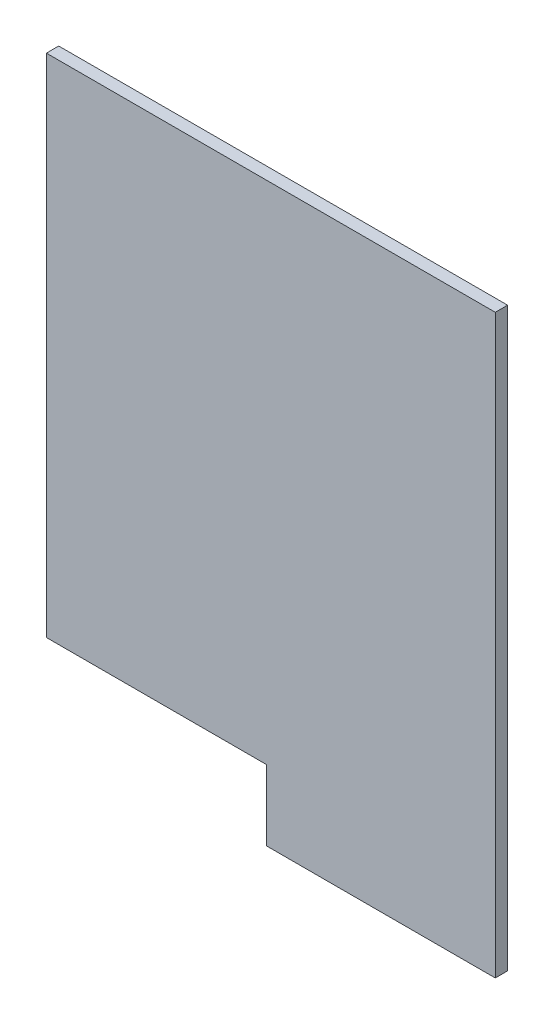
ISO-10303-21;
HEADER;
FILE_DESCRIPTION(('STEP AP214'),'2;1');
FILE_NAME('part.step','',(''),(''),'','','');
FILE_SCHEMA(('AUTOMOTIVE_DESIGN { 1 0 10303 214 1 1 1 1 }'));
ENDSEC;
DATA;
#1=APPLICATION_CONTEXT('core data for automotive mechanical design processes');
#2=APPLICATION_PROTOCOL_DEFINITION('international standard','automotive_design',2000,#1);
#3=PRODUCT_CONTEXT('',#1,'mechanical');
#4=PRODUCT('Part','Part','',(#3));
#5=PRODUCT_RELATED_PRODUCT_CATEGORY('part','',(#4));
#6=PRODUCT_DEFINITION_FORMATION('','',#4);
#7=PRODUCT_DEFINITION_CONTEXT('part definition',#1,'design');
#8=PRODUCT_DEFINITION('design','',#6,#7);
#9=PRODUCT_DEFINITION_SHAPE('','',#8);
#10=(LENGTH_UNIT() NAMED_UNIT(*) SI_UNIT(.MILLI.,.METRE.));
#11=(NAMED_UNIT(*) PLANE_ANGLE_UNIT() SI_UNIT($,.RADIAN.));
#12=(NAMED_UNIT(*) SI_UNIT($,.STERADIAN.) SOLID_ANGLE_UNIT());
#13=UNCERTAINTY_MEASURE_WITH_UNIT(LENGTH_MEASURE(1.E-05),#10,'distance_accuracy_value','');
#14=(GEOMETRIC_REPRESENTATION_CONTEXT(3) GLOBAL_UNCERTAINTY_ASSIGNED_CONTEXT((#13)) GLOBAL_UNIT_ASSIGNED_CONTEXT((#10,
#11,#12)) REPRESENTATION_CONTEXT('',''));
#15=CARTESIAN_POINT('',(0.,0.,0.));
#16=DIRECTION('',(0.,0.,1.));
#17=DIRECTION('',(1.,0.,0.));
#18=AXIS2_PLACEMENT_3D('',#15,#16,#17);
#19=CARTESIAN_POINT('',(5100.,0.,140.));
#20=DIRECTION('',(0.,-1.,0.));
#21=DIRECTION('',(0.,0.,-1.));
#22=AXIS2_PLACEMENT_3D('',#19,#20,#21);
#23=PLANE('',#22);
#24=DIRECTION('',(-1.,0.,0.));
#25=VECTOR('',#24,1.);
#26=CARTESIAN_POINT('',(5100.,0.,0.));
#27=LINE('',#26,#25);
#28=CARTESIAN_POINT('',(5100.,0.,0.));
#29=VERTEX_POINT('',#28);
#30=CARTESIAN_POINT('',(0.,0.,0.));
#31=VERTEX_POINT('',#30);
#32=EDGE_CURVE('E122',#29,#31,#27,.T.);
#33=ORIENTED_EDGE('',*,*,#32,.T.);
#34=DIRECTION('',(0.,0.,-1.));
#35=VECTOR('',#34,1.);
#36=CARTESIAN_POINT('',(0.,0.,140.));
#37=LINE('',#36,#35);
#38=CARTESIAN_POINT('',(0.,0.,140.));
#39=VERTEX_POINT('',#38);
#40=EDGE_CURVE('E11',#39,#31,#37,.T.);
#41=ORIENTED_EDGE('',*,*,#40,.F.);
#42=DIRECTION('',(-1.,0.,0.));
#43=VECTOR('',#42,1.);
#44=CARTESIAN_POINT('',(5100.,0.,140.));
#45=LINE('',#44,#43);
#46=CARTESIAN_POINT('',(5100.,0.,140.));
#47=VERTEX_POINT('',#46);
#48=EDGE_CURVE('E132',#47,#39,#45,.T.);
#49=ORIENTED_EDGE('',*,*,#48,.F.);
#50=DIRECTION('',(0.,0.,-1.));
#51=VECTOR('',#50,1.);
#52=CARTESIAN_POINT('',(5100.,0.,140.));
#53=LINE('',#52,#51);
#54=EDGE_CURVE('E118',#47,#29,#53,.T.);
#55=ORIENTED_EDGE('',*,*,#54,.T.);
#56=EDGE_LOOP('',(#33,#41,#49,#55));
#57=FACE_BOUND('',#56,.T.);
#58=ADVANCED_FACE('F38',(#57),#23,.F.);
#59=CARTESIAN_POINT('',(0.,0.,140.));
#60=DIRECTION('',(1.,0.,0.));
#61=DIRECTION('',(0.,1.,0.));
#62=AXIS2_PLACEMENT_3D('',#59,#60,#61);
#63=PLANE('',#62);
#64=DIRECTION('',(0.,-1.,0.));
#65=VECTOR('',#64,1.);
#66=CARTESIAN_POINT('',(0.,0.,0.));
#67=LINE('',#66,#65);
#68=CARTESIAN_POINT('',(7.04171909509728E-13,-5750.,0.));
#69=VERTEX_POINT('',#68);
#70=EDGE_CURVE('E125',#31,#69,#67,.T.);
#71=ORIENTED_EDGE('',*,*,#70,.T.);
#72=DIRECTION('',(0.,0.,-1.));
#73=VECTOR('',#72,1.);
#74=CARTESIAN_POINT('',(7.04171909509728E-13,-5750.,140.));
#75=LINE('',#74,#73);
#76=CARTESIAN_POINT('',(7.04171909509728E-13,-5750.,140.));
#77=VERTEX_POINT('',#76);
#78=EDGE_CURVE('E46',#77,#69,#75,.T.);
#79=ORIENTED_EDGE('',*,*,#78,.F.);
#80=DIRECTION('',(0.,-1.,0.));
#81=VECTOR('',#80,1.);
#82=CARTESIAN_POINT('',(0.,0.,140.));
#83=LINE('',#82,#81);
#84=EDGE_CURVE('E91',#39,#77,#83,.T.);
#85=ORIENTED_EDGE('',*,*,#84,.F.);
#86=ORIENTED_EDGE('',*,*,#40,.T.);
#87=EDGE_LOOP('',(#71,#79,#85,#86));
#88=FACE_BOUND('',#87,.T.);
#89=ADVANCED_FACE('F157',(#88),#63,.F.);
#90=CARTESIAN_POINT('',(7.04171909509728E-13,-5750.,140.));
#91=DIRECTION('',(0.,1.,0.));
#92=DIRECTION('',(0.,0.,1.));
#93=AXIS2_PLACEMENT_3D('',#90,#91,#92);
#94=PLANE('',#93);
#95=DIRECTION('',(1.,0.,0.));
#96=VECTOR('',#95,1.);
#97=CARTESIAN_POINT('',(7.04171909509728E-13,-5750.,0.));
#98=LINE('',#97,#96);
#99=CARTESIAN_POINT('',(2500.,-5750.,0.));
#100=VERTEX_POINT('',#99);
#101=EDGE_CURVE('E127',#69,#100,#98,.T.);
#102=ORIENTED_EDGE('',*,*,#101,.T.);
#103=DIRECTION('',(0.,0.,-1.));
#104=VECTOR('',#103,1.);
#105=CARTESIAN_POINT('',(2500.,-5750.,140.));
#106=LINE('',#105,#104);
#107=CARTESIAN_POINT('',(2500.,-5750.,140.));
#108=VERTEX_POINT('',#107);
#109=EDGE_CURVE('E113',#108,#100,#106,.T.);
#110=ORIENTED_EDGE('',*,*,#109,.F.);
#111=DIRECTION('',(1.,0.,0.));
#112=VECTOR('',#111,1.);
#113=CARTESIAN_POINT('',(7.04171909509728E-13,-5750.,140.));
#114=LINE('',#113,#112);
#115=EDGE_CURVE('E104',#77,#108,#114,.T.);
#116=ORIENTED_EDGE('',*,*,#115,.F.);
#117=ORIENTED_EDGE('',*,*,#78,.T.);
#118=EDGE_LOOP('',(#102,#110,#116,#117));
#119=FACE_BOUND('',#118,.T.);
#120=ADVANCED_FACE('F138',(#119),#94,.F.);
#121=CARTESIAN_POINT('',(2500.,-5750.,140.));
#122=DIRECTION('',(1.,0.,0.));
#123=DIRECTION('',(0.,0.,-1.));
#124=AXIS2_PLACEMENT_3D('',#121,#122,#123);
#125=PLANE('',#124);
#126=DIRECTION('',(0.,-1.,0.));
#127=VECTOR('',#126,1.);
#128=CARTESIAN_POINT('',(2500.,-5750.,0.));
#129=LINE('',#128,#127);
#130=CARTESIAN_POINT('',(2500.,-6550.,0.));
#131=VERTEX_POINT('',#130);
#132=EDGE_CURVE('E112',#100,#131,#129,.T.);
#133=ORIENTED_EDGE('',*,*,#132,.T.);
#134=DIRECTION('',(0.,0.,-1.));
#135=VECTOR('',#134,1.);
#136=CARTESIAN_POINT('',(2500.,-6550.,140.));
#137=LINE('',#136,#135);
#138=CARTESIAN_POINT('',(2500.,-6550.,140.));
#139=VERTEX_POINT('',#138);
#140=EDGE_CURVE('E109',#139,#131,#137,.T.);
#141=ORIENTED_EDGE('',*,*,#140,.F.);
#142=DIRECTION('',(0.,-1.,0.));
#143=VECTOR('',#142,1.);
#144=CARTESIAN_POINT('',(2500.,-5750.,140.));
#145=LINE('',#144,#143);
#146=EDGE_CURVE('E98',#108,#139,#145,.T.);
#147=ORIENTED_EDGE('',*,*,#146,.F.);
#148=ORIENTED_EDGE('',*,*,#109,.T.);
#149=EDGE_LOOP('',(#133,#141,#147,#148));
#150=FACE_BOUND('',#149,.T.);
#151=ADVANCED_FACE('F110',(#150),#125,.F.);
#152=CARTESIAN_POINT('',(2500.,-6550.,140.));
#153=DIRECTION('',(0.,1.,0.));
#154=DIRECTION('',(0.,0.,1.));
#155=AXIS2_PLACEMENT_3D('',#152,#153,#154);
#156=PLANE('',#155);
#157=DIRECTION('',(1.,0.,0.));
#158=VECTOR('',#157,1.);
#159=CARTESIAN_POINT('',(2500.,-6550.,0.));
#160=LINE('',#159,#158);
#161=CARTESIAN_POINT('',(5100.,-6550.,0.));
#162=VERTEX_POINT('',#161);
#163=EDGE_CURVE('E77',#131,#162,#160,.T.);
#164=ORIENTED_EDGE('',*,*,#163,.T.);
#165=DIRECTION('',(0.,0.,-1.));
#166=VECTOR('',#165,1.);
#167=CARTESIAN_POINT('',(5100.,-6550.,140.));
#168=LINE('',#167,#166);
#169=CARTESIAN_POINT('',(5100.,-6550.,140.));
#170=VERTEX_POINT('',#169);
#171=EDGE_CURVE('E114',#170,#162,#168,.T.);
#172=ORIENTED_EDGE('',*,*,#171,.F.);
#173=DIRECTION('',(1.,0.,0.));
#174=VECTOR('',#173,1.);
#175=CARTESIAN_POINT('',(2500.,-6550.,140.));
#176=LINE('',#175,#174);
#177=EDGE_CURVE('E102',#139,#170,#176,.T.);
#178=ORIENTED_EDGE('',*,*,#177,.F.);
#179=ORIENTED_EDGE('',*,*,#140,.T.);
#180=EDGE_LOOP('',(#164,#172,#178,#179));
#181=FACE_BOUND('',#180,.T.);
#182=ADVANCED_FACE('F116',(#181),#156,.F.);
#183=CARTESIAN_POINT('',(5100.,-6550.,140.));
#184=DIRECTION('',(-1.,0.,0.));
#185=DIRECTION('',(0.,0.,1.));
#186=AXIS2_PLACEMENT_3D('',#183,#184,#185);
#187=PLANE('',#186);
#188=DIRECTION('',(0.,1.,0.));
#189=VECTOR('',#188,1.);
#190=CARTESIAN_POINT('',(5100.,-6550.,0.));
#191=LINE('',#190,#189);
#192=EDGE_CURVE('E83',#162,#29,#191,.T.);
#193=ORIENTED_EDGE('',*,*,#192,.T.);
#194=ORIENTED_EDGE('',*,*,#54,.F.);
#195=DIRECTION('',(0.,1.,0.));
#196=VECTOR('',#195,1.);
#197=CARTESIAN_POINT('',(5100.,-6550.,140.));
#198=LINE('',#197,#196);
#199=EDGE_CURVE('E54',#170,#47,#198,.T.);
#200=ORIENTED_EDGE('',*,*,#199,.F.);
#201=ORIENTED_EDGE('',*,*,#171,.T.);
#202=EDGE_LOOP('',(#193,#194,#200,#201));
#203=FACE_BOUND('',#202,.T.);
#204=ADVANCED_FACE('F145',(#203),#187,.F.);
#205=CARTESIAN_POINT('',(0.,0.,140.));
#206=DIRECTION('',(0.,0.,1.));
#207=DIRECTION('',(1.,0.,0.));
#208=AXIS2_PLACEMENT_3D('',#205,#206,#207);
#209=PLANE('',#208);
#210=ORIENTED_EDGE('',*,*,#48,.T.);
#211=ORIENTED_EDGE('',*,*,#84,.T.);
#212=ORIENTED_EDGE('',*,*,#115,.T.);
#213=ORIENTED_EDGE('',*,*,#146,.T.);
#214=ORIENTED_EDGE('',*,*,#177,.T.);
#215=ORIENTED_EDGE('',*,*,#199,.T.);
#216=EDGE_LOOP('',(#210,#211,#212,#213,#214,#215));
#217=FACE_BOUND('',#216,.T.);
#218=ADVANCED_FACE('F100',(#217),#209,.T.);
#219=CARTESIAN_POINT('',(0.,0.,0.));
#220=DIRECTION('',(0.,0.,1.));
#221=DIRECTION('',(1.,0.,0.));
#222=AXIS2_PLACEMENT_3D('',#219,#220,#221);
#223=PLANE('',#222);
#224=ORIENTED_EDGE('',*,*,#32,.F.);
#225=ORIENTED_EDGE('',*,*,#192,.F.);
#226=ORIENTED_EDGE('',*,*,#163,.F.);
#227=ORIENTED_EDGE('',*,*,#132,.F.);
#228=ORIENTED_EDGE('',*,*,#101,.F.);
#229=ORIENTED_EDGE('',*,*,#70,.F.);
#230=EDGE_LOOP('',(#224,#225,#226,#227,#228,#229));
#231=FACE_BOUND('',#230,.T.);
#232=ADVANCED_FACE('F141',(#231),#223,.F.);
#233=CLOSED_SHELL('',(#58,#89,#120,#151,#182,#204,#218,#232));
#234=MANIFOLD_SOLID_BREP('B2',#233);
#235=ADVANCED_BREP_SHAPE_REPRESENTATION('',(#18,#234),#14);
#236=SHAPE_DEFINITION_REPRESENTATION(#9,#235);
ENDSEC;
END-ISO-10303-21;
